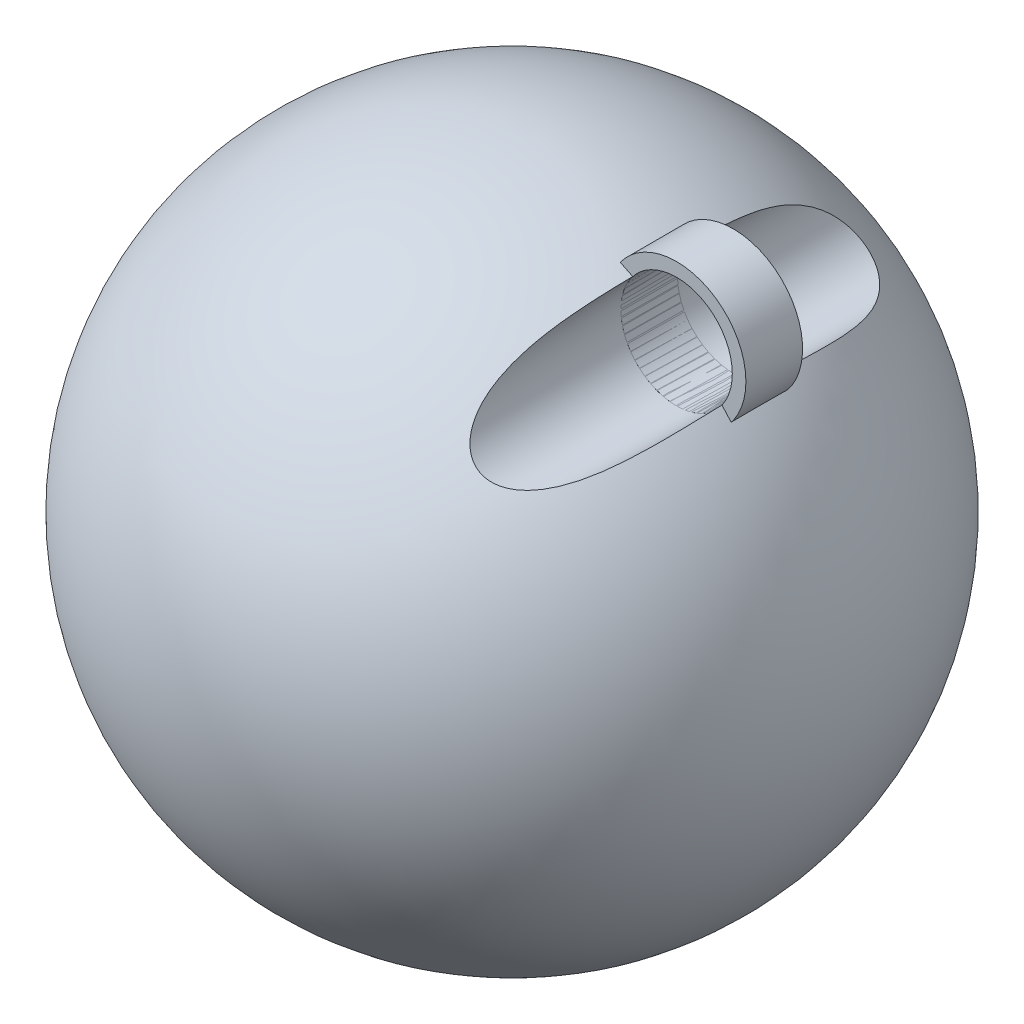
ISO-10303-21;
HEADER;
FILE_DESCRIPTION(('STEP AP214'),'2;1');
FILE_NAME('part.step','',(''),(''),'','','');
FILE_SCHEMA(('AUTOMOTIVE_DESIGN { 1 0 10303 214 1 1 1 1 }'));
ENDSEC;
DATA;
#1=APPLICATION_CONTEXT('core data for automotive mechanical design processes');
#2=APPLICATION_PROTOCOL_DEFINITION('international standard','automotive_design',2000,#1);
#3=PRODUCT_CONTEXT('',#1,'mechanical');
#4=PRODUCT('Part','Part','',(#3));
#5=PRODUCT_RELATED_PRODUCT_CATEGORY('part','',(#4));
#6=PRODUCT_DEFINITION_FORMATION('','',#4);
#7=PRODUCT_DEFINITION_CONTEXT('part definition',#1,'design');
#8=PRODUCT_DEFINITION('design','',#6,#7);
#9=PRODUCT_DEFINITION_SHAPE('','',#8);
#10=(LENGTH_UNIT() NAMED_UNIT(*) SI_UNIT(.MILLI.,.METRE.));
#11=(NAMED_UNIT(*) PLANE_ANGLE_UNIT() SI_UNIT($,.RADIAN.));
#12=(NAMED_UNIT(*) SI_UNIT($,.STERADIAN.) SOLID_ANGLE_UNIT());
#13=UNCERTAINTY_MEASURE_WITH_UNIT(LENGTH_MEASURE(1.E-05),#10,'distance_accuracy_value','');
#14=(GEOMETRIC_REPRESENTATION_CONTEXT(3) GLOBAL_UNCERTAINTY_ASSIGNED_CONTEXT((#13)) GLOBAL_UNIT_ASSIGNED_CONTEXT((#10,
#11,#12)) REPRESENTATION_CONTEXT('',''));
#15=CARTESIAN_POINT('',(0.,0.,0.));
#16=DIRECTION('',(0.,0.,1.));
#17=DIRECTION('',(1.,0.,0.));
#18=AXIS2_PLACEMENT_3D('',#15,#16,#17);
#19=CARTESIAN_POINT('',(170.114345327944,-163.089759289935,25.));
#20=DIRECTION('',(0.,0.,1.));
#21=DIRECTION('',(1.,0.,0.));
#22=AXIS2_PLACEMENT_3D('',#19,#20,#21);
#23=PLANE('',#22);
#24=CARTESIAN_POINT('',(170.114345327944,-163.089759289935,25.));
#25=DIRECTION('',(0.,0.,1.));
#26=DIRECTION('',(1.,0.,0.));
#27=AXIS2_PLACEMENT_3D('',#24,#25,#26);
#28=CIRCLE('',#27,61.1488225866109);
#29=CARTESIAN_POINT('',(231.263167914555,-163.089759289935,25.));
#30=VERTEX_POINT('',#29);
#31=EDGE_CURVE('E11',#30,#30,#28,.T.);
#32=ORIENTED_EDGE('',*,*,#31,.T.);
#33=EDGE_LOOP('',(#32));
#34=FACE_BOUND('',#33,.T.);
#35=CARTESIAN_POINT('',(170.114345327944,-163.089759289935,25.));
#36=DIRECTION('',(0.,0.,1.));
#37=DIRECTION('',(1.,0.,0.));
#38=AXIS2_PLACEMENT_3D('',#35,#36,#37);
#39=CIRCLE('',#38,49.1488225866109);
#40=CARTESIAN_POINT('',(219.263167914555,-163.089759289935,25.));
#41=VERTEX_POINT('',#40);
#42=EDGE_CURVE('E52',#41,#41,#39,.T.);
#43=ORIENTED_EDGE('',*,*,#42,.F.);
#44=EDGE_LOOP('',(#43));
#45=FACE_BOUND('',#44,.T.);
#46=ADVANCED_FACE('F41',(#34,#45),#23,.T.);
#47=CARTESIAN_POINT('',(170.114345327944,-163.089759289935,-25.));
#48=DIRECTION('',(0.,0.,1.));
#49=DIRECTION('',(1.,0.,0.));
#50=AXIS2_PLACEMENT_3D('',#47,#48,#49);
#51=PLANE('',#50);
#52=CARTESIAN_POINT('',(170.114345327944,-163.089759289935,-25.));
#53=DIRECTION('',(0.,0.,1.));
#54=DIRECTION('',(-1.,0.,0.));
#55=AXIS2_PLACEMENT_3D('',#52,#53,#54);
#56=CIRCLE('',#55,61.1488225866109);
#57=CARTESIAN_POINT('',(108.965522741333,-163.089759289935,-25.));
#58=VERTEX_POINT('',#57);
#59=EDGE_CURVE('E45',#58,#58,#56,.T.);
#60=ORIENTED_EDGE('',*,*,#59,.F.);
#61=EDGE_LOOP('',(#60));
#62=FACE_BOUND('',#61,.T.);
#63=CARTESIAN_POINT('',(170.114345327944,-163.089759289935,-25.));
#64=DIRECTION('',(0.,0.,1.));
#65=DIRECTION('',(-1.,0.,0.));
#66=AXIS2_PLACEMENT_3D('',#63,#64,#65);
#67=CIRCLE('',#66,49.1488225866109);
#68=CARTESIAN_POINT('',(120.965522741333,-163.089759289935,-25.));
#69=VERTEX_POINT('',#68);
#70=EDGE_CURVE('E54',#69,#69,#67,.T.);
#71=ORIENTED_EDGE('',*,*,#70,.T.);
#72=EDGE_LOOP('',(#71));
#73=FACE_BOUND('',#72,.T.);
#74=ADVANCED_FACE('F63',(#62,#73),#51,.F.);
#75=CARTESIAN_POINT('',(170.114345327944,-163.089759289935,25.));
#76=DIRECTION('',(0.,0.,-1.));
#77=DIRECTION('',(-1.,0.,0.));
#78=AXIS2_PLACEMENT_3D('',#75,#76,#77);
#79=CYLINDRICAL_SURFACE('',#78,61.1488225866109);
#80=ORIENTED_EDGE('',*,*,#59,.T.);
#81=EDGE_LOOP('',(#80));
#82=FACE_BOUND('',#81,.T.);
#83=ORIENTED_EDGE('',*,*,#31,.F.);
#84=EDGE_LOOP('',(#83));
#85=FACE_BOUND('',#84,.T.);
#86=ADVANCED_FACE('F43',(#82,#85),#79,.T.);
#87=CARTESIAN_POINT('',(170.114345327944,-163.089759289935,25.));
#88=DIRECTION('',(0.,0.,-1.));
#89=DIRECTION('',(-1.,0.,0.));
#90=AXIS2_PLACEMENT_3D('',#87,#88,#89);
#91=CYLINDRICAL_SURFACE('',#90,49.1488225866109);
#92=ORIENTED_EDGE('',*,*,#70,.F.);
#93=EDGE_LOOP('',(#92));
#94=FACE_BOUND('',#93,.T.);
#95=ORIENTED_EDGE('',*,*,#42,.T.);
#96=EDGE_LOOP('',(#95));
#97=FACE_BOUND('',#96,.T.);
#98=ADVANCED_FACE('F60',(#94,#97),#91,.F.);
#99=CLOSED_SHELL('',(#46,#74,#86,#98));
#100=MANIFOLD_SOLID_BREP('B2',#99);
#101=CARTESIAN_POINT('',(0.,-390.791383279883,0.));
#102=DIRECTION('',(0.,1.,0.));
#103=DIRECTION('',(1.,0.,0.));
#104=AXIS2_PLACEMENT_3D('',#101,#102,#103);
#105=SPHERICAL_SURFACE('',#104,290.733724493296);
#106=CARTESIAN_POINT('',(210.837597788635,-190.60745306454,0.));
#107=CARTESIAN_POINT('',(210.837598958615,-190.607454582091,2.01970869666685));
#108=CARTESIAN_POINT('',(210.825540884066,-190.625322197502,4.03944002432575));
#109=CARTESIAN_POINT('',(210.777196159714,-190.696662967204,8.07803600027789));
#110=CARTESIAN_POINT('',(210.740908730778,-190.750137266482,10.0969006186117));
#111=CARTESIAN_POINT('',(210.643755225287,-190.89229725101,14.133039942072));
#112=CARTESIAN_POINT('',(210.582886235639,-190.980987109535,16.1503144303575));
#113=CARTESIAN_POINT('',(210.436004006402,-191.192912415484,20.1821121932454));
#114=CARTESIAN_POINT('',(210.349990979497,-191.3161475707,22.1966354909744));
#115=CARTESIAN_POINT('',(210.151960530952,-191.596347648735,26.2235850643362));
#116=CARTESIAN_POINT('',(210.039923534538,-191.753337954948,28.2360086102781));
#117=CARTESIAN_POINT('',(209.788881430431,-192.099821472211,32.2563740738974));
#118=CARTESIAN_POINT('',(209.649876256304,-192.289314763331,34.2643159805221));
#119=CARTESIAN_POINT('',(209.343701662322,-192.699383211796,38.2747814679282));
#120=CARTESIAN_POINT('',(209.176533473046,-192.919957011016,40.2773052815695));
#121=CARTESIAN_POINT('',(208.812630405065,-193.390550674776,44.2761953918061));
#122=CARTESIAN_POINT('',(208.615895543002,-193.640570522743,46.2725616918667));
#123=CARTESIAN_POINT('',(208.190669888815,-194.168941910349,50.2639889580814));
#124=CARTESIAN_POINT('',(207.962090435522,-194.44737194911,52.2590300899655));
#125=CARTESIAN_POINT('',(207.471819736524,-195.029871740964,56.2412899336603));
#126=CARTESIAN_POINT('',(207.210128448186,-195.333941527069,58.2285086353958));
#127=CARTESIAN_POINT('',(206.651655147238,-195.965425568919,62.1944394016872));
#128=CARTESIAN_POINT('',(206.354870629095,-196.292841490833,64.1731508483898));
#129=CARTESIAN_POINT('',(205.72409230294,-196.968458672744,68.1210715339619));
#130=CARTESIAN_POINT('',(205.390098604088,-197.316659871762,70.0902808006899));
#131=CARTESIAN_POINT('',(204.682906005877,-198.030762067019,74.0165673707267));
#132=CARTESIAN_POINT('',(204.309742215011,-198.39664705704,75.9736539011148));
#133=CARTESIAN_POINT('',(203.521478511531,-199.14339965041,79.876527234849));
#134=CARTESIAN_POINT('',(203.106378111917,-199.52426742772,81.822313906695));
#135=CARTESIAN_POINT('',(202.231646941506,-200.297641260784,85.701198097665));
#136=CARTESIAN_POINT('',(201.772023405326,-200.690145418561,87.6342976240131));
#137=CARTESIAN_POINT('',(200.805342750153,-201.483252586202,91.4868612127236));
#138=CARTESIAN_POINT('',(200.298287606098,-201.88385525832,93.4063258392327));
#139=CARTESIAN_POINT('',(199.236388849421,-202.687162263821,97.220476414304));
#140=CARTESIAN_POINT('',(198.681805095931,-203.089845113391,99.1152390923504));
#141=CARTESIAN_POINT('',(197.519372603209,-203.895042971176,102.888351129933));
#142=CARTESIAN_POINT('',(196.911525751961,-204.297557984832,104.766701068649));
#143=CARTESIAN_POINT('',(195.638778587633,-205.097799161152,108.505859445458));
#144=CARTESIAN_POINT('',(194.973857211907,-205.495523493594,110.366661123983));
#145=CARTESIAN_POINT('',(193.583321362438,-206.280632298934,114.067703094693));
#146=CARTESIAN_POINT('',(192.857707270244,-206.668016836813,115.907943516055));
#147=CARTESIAN_POINT('',(191.345988079359,-207.424106252077,119.55445647576));
#148=CARTESIAN_POINT('',(190.560257294487,-207.792906245502,121.360863948923));
#149=CARTESIAN_POINT('',(188.92014196635,-208.507256019495,124.947154206296));
#150=CARTESIAN_POINT('',(188.065752491861,-208.852804126777,126.727035074403));
#151=CARTESIAN_POINT('',(186.284243990706,-209.512198859396,130.254152162765));
#152=CARTESIAN_POINT('',(185.35719306221,-209.826074551523,132.001417092864));
#153=CARTESIAN_POINT('',(183.907785739474,-210.266047236191,134.594316398703));
#154=CARTESIAN_POINT('',(183.41488204009,-210.407555667736,135.453889547025));
#155=CARTESIAN_POINT('',(182.408715339696,-210.678905737093,137.162881398466));
#156=CARTESIAN_POINT('',(181.895453474931,-210.808748024706,138.012300664868));
#157=CARTESIAN_POINT('',(181.007536516204,-211.017674076955,139.44270429103));
#158=CARTESIAN_POINT('',(180.638328705885,-211.100164497358,140.026578181076));
#159=CARTESIAN_POINT('',(179.889485197215,-211.258211644856,141.188512029896));
#160=CARTESIAN_POINT('',(179.509849870199,-211.333768618442,141.766572194705));
#161=CARTESIAN_POINT('',(178.354918198143,-211.549160174947,143.491402226556));
#162=CARTESIAN_POINT('',(177.563538592855,-211.67772914253,144.628914634896));
#163=CARTESIAN_POINT('',(175.934651650875,-211.899671493773,146.876800061264));
#164=CARTESIAN_POINT('',(175.097073124525,-211.992988716115,147.98712715962));
#165=CARTESIAN_POINT('',(173.374878503983,-212.137924418238,150.173677846923));
#166=CARTESIAN_POINT('',(172.49026254574,-212.189543018529,151.24990153442));
#167=CARTESIAN_POINT('',(170.664607735727,-212.244057301531,153.37052197647));
#168=CARTESIAN_POINT('',(169.723161735851,-212.246545290171,154.414580689146));
#169=CARTESIAN_POINT('',(167.788942421119,-212.193073047921,156.453149152825));
#170=CARTESIAN_POINT('',(166.796160959021,-212.137103512247,157.447650989372));
#171=CARTESIAN_POINT('',(164.760814327533,-211.956808300346,159.37419975286));
#172=CARTESIAN_POINT('',(163.718346919355,-211.832612175565,160.306361302719));
#173=CARTESIAN_POINT('',(161.583224537301,-211.504552320303,162.096136272709));
#174=CARTESIAN_POINT('',(160.490597118145,-211.300731878953,162.953789891182));
#175=CARTESIAN_POINT('',(158.670130457582,-210.893085835918,164.278044647717));
#176=CARTESIAN_POINT('',(157.956148252519,-210.716909061854,164.772334523284));
#177=CARTESIAN_POINT('',(156.511256992931,-210.324526115781,165.719108080477));
#178=CARTESIAN_POINT('',(155.780345026342,-210.108313011769,166.171584502037));
#179=CARTESIAN_POINT('',(154.304465861058,-209.632808585065,167.028697998473));
#180=CARTESIAN_POINT('',(153.559498693743,-209.373517358543,167.433335180146));
#181=CARTESIAN_POINT('',(152.05966229757,-208.809302810648,168.188180264983));
#182=CARTESIAN_POINT('',(151.304798096822,-208.504401899319,168.538414727281));
#183=CARTESIAN_POINT('',(149.78037298893,-207.842805035192,169.182031928471));
#184=CARTESIAN_POINT('',(149.01074641309,-207.48550830941,169.474647847077));
#185=CARTESIAN_POINT('',(147.472795022065,-206.721216100618,169.990737050309));
#186=CARTESIAN_POINT('',(146.704470198603,-206.314220934778,170.214210776162));
#187=CARTESIAN_POINT('',(145.177994835921,-205.45191760678,170.585851546221));
#188=CARTESIAN_POINT('',(144.419832375812,-204.996672895791,170.73411604553));
#189=CARTESIAN_POINT('',(142.92138419683,-204.040205839355,170.951384021044));
#190=CARTESIAN_POINT('',(142.18109518079,-203.538992057102,171.020402227124));
#191=CARTESIAN_POINT('',(140.833126472211,-202.571424248958,171.072970565847));
#192=CARTESIAN_POINT('',(140.22184700521,-202.110639441859,171.067513105392));
#193=CARTESIAN_POINT('',(139.02361206709,-201.162799211314,170.997422597534));
#194=CARTESIAN_POINT('',(138.436653939412,-200.675746670472,170.93279603093));
#195=CARTESIAN_POINT('',(137.291128532372,-199.679643256719,170.745812474317));
#196=CARTESIAN_POINT('',(136.732568062335,-199.170587161328,170.623441709782));
#197=CARTESIAN_POINT('',(135.647185697444,-198.135219165598,170.323594950034));
#198=CARTESIAN_POINT('',(135.120364792487,-197.608906727857,170.146117237201));
#199=CARTESIAN_POINT('',(134.124284390231,-196.568362210911,169.749005971127));
#200=CARTESIAN_POINT('',(133.653488542787,-196.054701570457,169.531708697142));
#201=CARTESIAN_POINT('',(132.743703427767,-195.019630734949,169.053720873291));
#202=CARTESIAN_POINT('',(132.30471203136,-194.498221061397,168.793033231617));
#203=CARTESIAN_POINT('',(131.458694640936,-193.450929150136,168.231944495868));
#204=CARTESIAN_POINT('',(131.051669217807,-192.925046832733,167.931542692784));
#205=CARTESIAN_POINT('',(130.26910885842,-191.871605582049,167.294686589024));
#206=CARTESIAN_POINT('',(129.893581581504,-191.344046273159,166.958223564458));
#207=CARTESIAN_POINT('',(128.947641733981,-189.959576524706,166.031911931746));
#208=CARTESIAN_POINT('',(128.402399418798,-189.103240120558,165.415300807517));
#209=CARTESIAN_POINT('',(127.387628312007,-187.400619002815,164.110016423109));
#210=CARTESIAN_POINT('',(126.91813946039,-186.554339808143,163.421305462715));
#211=CARTESIAN_POINT('',(126.047548038708,-184.875541549987,161.982084113617));
#212=CARTESIAN_POINT('',(125.646615119495,-184.043061097903,161.231427040259));
#213=CARTESIAN_POINT('',(124.907891368782,-182.397701134824,159.679697342722));
#214=CARTESIAN_POINT('',(124.570097280813,-181.584820614822,158.878627321507));
#215=CARTESIAN_POINT('',(124.002458368011,-180.113710934646,157.370240947969));
#216=CARTESIAN_POINT('',(123.764000300545,-179.452154811468,156.669354120518));
#217=CARTESIAN_POINT('',(123.32306724717,-178.144955837082,155.241753189245));
#218=CARTESIAN_POINT('',(123.120597481919,-177.499315306356,154.515035356557));
#219=CARTESIAN_POINT('',(122.748381673794,-176.224202480762,153.038703947647));
#220=CARTESIAN_POINT('',(122.578654383695,-175.594739629238,152.289077533881));
#221=CARTESIAN_POINT('',(122.269137943259,-174.352641298138,150.770069652899));
#222=CARTESIAN_POINT('',(122.129347638585,-173.740005170535,150.000688948668));
#223=CARTESIAN_POINT('',(121.876848376629,-172.530769528413,148.443343126605));
#224=CARTESIAN_POINT('',(121.764177877114,-171.934193840366,147.655353337252));
#225=CARTESIAN_POINT('',(121.563735904175,-170.757940755776,146.063787646781));
#226=CARTESIAN_POINT('',(121.475964392312,-170.178263333148,145.260211769726));
#227=CARTESIAN_POINT('',(121.323124998667,-169.035818683667,143.639326751395));
#228=CARTESIAN_POINT('',(121.258051597601,-168.473047376376,142.822020999417));
#229=CARTESIAN_POINT('',(121.148564504752,-167.364047330181,141.174849977928));
#230=CARTESIAN_POINT('',(121.104152075435,-166.81781960406,140.344983944132));
#231=CARTESIAN_POINT('',(121.034960938849,-165.754034749093,138.693087685374));
#232=CARTESIAN_POINT('',(121.009755868684,-165.236107502346,137.871313280703));
#233=CARTESIAN_POINT('',(120.97576828294,-164.215609391513,136.217931783849));
#234=CARTESIAN_POINT('',(120.966986482925,-163.713039197474,135.386324264826));
#235=CARTESIAN_POINT('',(120.963096996661,-162.227854193371,132.877829718026));
#236=CARTESIAN_POINT('',(120.990451216586,-161.267865704533,131.187427628832));
#237=CARTESIAN_POINT('',(121.094925935914,-159.405559789903,127.77520234297));
#238=CARTESIAN_POINT('',(121.172085174856,-158.503287858399,126.053355701892));
#239=CARTESIAN_POINT('',(121.367534489703,-156.755037770473,122.583815522603));
#240=CARTESIAN_POINT('',(121.485822205515,-155.909056387225,120.836123472998));
#241=CARTESIAN_POINT('',(121.75636022008,-154.269078752489,117.313637017968));
#242=CARTESIAN_POINT('',(121.908698057517,-153.475223441363,115.53878394159));
#243=CARTESIAN_POINT('',(122.240525154728,-151.939830725788,111.969151547874));
#244=CARTESIAN_POINT('',(122.420014484041,-151.198293455342,110.174372179512));
#245=CARTESIAN_POINT('',(122.800209371282,-149.765787725848,106.567675680821));
#246=CARTESIAN_POINT('',(123.000908232566,-149.074803421249,104.75576412331));
#247=CARTESIAN_POINT('',(123.418327835093,-147.74124675897,101.116004260348));
#248=CARTESIAN_POINT('',(123.635049122851,-147.098676054154,99.2881554131623));
#249=CARTESIAN_POINT('',(124.075534212393,-145.872002981992,95.653093275471));
#250=CARTESIAN_POINT('',(124.29908498003,-145.287019482522,93.8461509312504));
#251=CARTESIAN_POINT('',(124.752986963876,-144.160343608601,90.2196099918483));
#252=CARTESIAN_POINT('',(124.983338437894,-143.618652878237,88.4000109188646));
#253=CARTESIAN_POINT('',(125.447142502013,-142.577011730233,84.74902219296));
#254=CARTESIAN_POINT('',(125.680595538211,-142.077067393977,82.9176308639181));
#255=CARTESIAN_POINT('',(126.147138088071,-141.117595214854,79.2442778810777));
#256=CARTESIAN_POINT('',(126.380227605548,-140.658066945162,77.4023163391275));
#257=CARTESIAN_POINT('',(126.843050131485,-139.777761692372,73.7072877774297));
#258=CARTESIAN_POINT('',(127.072780536344,-139.35701355318,71.8542135660787));
#259=CARTESIAN_POINT('',(127.525775736067,-138.553393453466,68.1390848348613));
#260=CARTESIAN_POINT('',(127.749040514031,-138.170521591937,66.2770302915375));
#261=CARTESIAN_POINT('',(128.186380159121,-137.441500686264,62.5447869888565));
#262=CARTESIAN_POINT('',(128.400455547581,-137.095349557232,60.6745986975905));
#263=CARTESIAN_POINT('',(128.816930863831,-136.438652459194,56.9266904307424));
#264=CARTESIAN_POINT('',(129.019330802052,-136.128106458373,55.0489704618911));
#265=CARTESIAN_POINT('',(129.410090402344,-135.541719737287,51.2873908482343));
#266=CARTESIAN_POINT('',(129.598455282864,-135.265866091363,49.4035337599787));
#267=CARTESIAN_POINT('',(129.959144683675,-134.747807230096,45.629667669437));
#268=CARTESIAN_POINT('',(130.131469203326,-134.505602016094,43.739658666906));
#269=CARTESIAN_POINT('',(130.458204291972,-134.054006876645,39.9541642645475));
#270=CARTESIAN_POINT('',(130.612614721225,-133.844617207178,38.058678822118));
#271=CARTESIAN_POINT('',(130.901859500353,-133.457917943395,34.2629471641425));
#272=CARTESIAN_POINT('',(131.036693851045,-133.28060834774,32.362700948795));
#273=CARTESIAN_POINT('',(131.285298213789,-132.957494155715,28.5589203311764));
#274=CARTESIAN_POINT('',(131.399076588467,-132.81167704788,26.6553875386965));
#275=CARTESIAN_POINT('',(131.604428028867,-132.550922110568,22.8450120368033));
#276=CARTESIAN_POINT('',(131.69600110686,-132.435984264026,20.9381693292198));
#277=CARTESIAN_POINT('',(131.855973267148,-132.236557257214,17.12191850834));
#278=CARTESIAN_POINT('',(131.92437233257,-132.152068119112,15.2125103931768));
#279=CARTESIAN_POINT('',(132.037274310009,-132.013217867966,11.3918901926049));
#280=CARTESIAN_POINT('',(132.081777181122,-131.95885680649,9.48067810411391));
#281=CARTESIAN_POINT('',(132.147736881478,-131.878443249454,5.57907466527623));
#282=CARTESIAN_POINT('',(132.168177299464,-131.853638753012,3.58864019569804));
#283=CARTESIAN_POINT('',(132.182423169999,-131.836340892232,-0.392466807619412));
#284=CARTESIAN_POINT('',(132.176228574989,-131.843847585589,-2.38313934177743));
#285=CARTESIAN_POINT('',(132.137275277884,-131.891203990236,-6.3638601449181));
#286=CARTESIAN_POINT('',(132.104516302948,-131.931054033722,-8.35390840727887));
#287=CARTESIAN_POINT('',(132.012808341637,-132.043263714588,-12.3324825917722));
#288=CARTESIAN_POINT('',(131.953859366327,-132.115623338235,-14.3210085145476));
#289=CARTESIAN_POINT('',(131.810419029478,-132.293184509771,-18.2964117431795));
#290=CARTESIAN_POINT('',(131.725918183824,-132.398398252635,-20.2832881617349));
#291=CARTESIAN_POINT('',(131.532350102816,-132.64208920226,-24.2538009533437));
#292=CARTESIAN_POINT('',(131.423282860738,-132.780566418126,-26.2374373255102));
#293=CARTESIAN_POINT('',(131.181836014308,-133.091339452485,-30.2006166838031));
#294=CARTESIAN_POINT('',(131.049456641538,-133.263634935029,-32.1801597103951));
#295=CARTESIAN_POINT('',(130.762911795131,-133.64272398372,-36.1343583827567));
#296=CARTESIAN_POINT('',(130.608746322855,-133.849517547709,-38.1090140288319));
#297=CARTESIAN_POINT('',(130.280319615304,-134.298535461446,-42.0538478685124));
#298=CARTESIAN_POINT('',(130.106046155676,-134.540781388202,-44.0240225880389));
#299=CARTESIAN_POINT('',(129.739527818705,-135.061519169144,-47.9579014451521));
#300=CARTESIAN_POINT('',(129.547282926619,-135.340011053065,-49.9216055774295));
#301=CARTESIAN_POINT('',(129.147108056613,-135.934270768396,-53.8418596191302));
#302=CARTESIAN_POINT('',(128.939177334436,-136.250040368955,-55.7984091844611));
#303=CARTESIAN_POINT('',(128.510177985743,-136.919963140701,-59.7034784362853));
#304=CARTESIAN_POINT('',(128.289109388812,-137.274116225453,-61.6519981408504));
#305=CARTESIAN_POINT('',(127.836750412099,-138.021800979861,-65.5390563574377));
#306=CARTESIAN_POINT('',(127.605466225551,-138.415308968587,-67.4776001425465));
#307=CARTESIAN_POINT('',(127.135574514885,-139.243196034339,-71.3450745466103));
#308=CARTESIAN_POINT('',(126.896966924201,-139.677575482943,-73.274005078));
#309=CARTESIAN_POINT('',(126.415743379486,-140.588552827664,-77.1211186601131));
#310=CARTESIAN_POINT('',(126.173127932719,-141.065145413773,-79.0393030304162));
#311=CARTESIAN_POINT('',(125.687428149807,-142.062081257018,-82.8641536182408));
#312=CARTESIAN_POINT('',(125.444343829345,-142.582423074886,-84.7708202124654));
#313=CARTESIAN_POINT('',(124.959443580326,-143.673245098473,-88.5883543131187));
#314=CARTESIAN_POINT('',(124.71765760581,-144.244125988318,-90.4991113060281));
#315=CARTESIAN_POINT('',(124.24187743498,-145.433772354823,-94.3065833249877));
#316=CARTESIAN_POINT('',(124.00788295171,-146.052536065197,-96.2032988661695));
#317=CARTESIAN_POINT('',(123.552392668802,-147.339913395024,-99.9816099724084));
#318=CARTESIAN_POINT('',(123.330898785581,-148.008534621659,-101.863203181406));
#319=CARTESIAN_POINT('',(122.905697210084,-149.397503320921,-105.609273280036));
#320=CARTESIAN_POINT('',(122.70198953447,-150.117850842004,-107.473750153633));
#321=CARTESIAN_POINT('',(122.318875464879,-151.609735562428,-111.177058382529));
#322=CARTESIAN_POINT('',(122.139386763872,-152.38108539305,-113.015956518327));
#323=CARTESIAN_POINT('',(121.810370801944,-153.979399667238,-116.672295643198));
#324=CARTESIAN_POINT('',(121.660844739064,-154.806366332853,-118.489735771549));
#325=CARTESIAN_POINT('',(121.399216527299,-156.517698391699,-122.099029963055));
#326=CARTESIAN_POINT('',(121.28709450411,-157.402033003652,-123.890897128125));
#327=CARTESIAN_POINT('',(121.108647207785,-159.230698289591,-127.445855729292));
#328=CARTESIAN_POINT('',(121.042315305086,-160.175020256887,-129.208951294881));
#329=CARTESIAN_POINT('',(120.967965360391,-162.057900876383,-132.579431704341));
#330=CARTESIAN_POINT('',(120.956190475936,-162.992236044675,-134.189077319039));
#331=CARTESIAN_POINT('',(120.981600005643,-164.435594849647,-136.577721000067));
#332=CARTESIAN_POINT('',(120.997249784398,-164.923708155925,-137.369658518035));
#333=CARTESIAN_POINT('',(121.044236927506,-165.914139337299,-138.944168274912));
#334=CARTESIAN_POINT('',(121.075574400587,-166.416457310819,-139.726740448875));
#335=CARTESIAN_POINT('',(121.155406324068,-167.436124230112,-141.282561234478));
#336=CARTESIAN_POINT('',(121.203922239029,-167.953491234005,-142.055796924432));
#337=CARTESIAN_POINT('',(121.31966255762,-169.002823513351,-143.590878878154));
#338=CARTESIAN_POINT('',(121.386886602203,-169.534788508462,-144.352725360209));
#339=CARTESIAN_POINT('',(121.541737676517,-170.613413964997,-145.863751373903));
#340=CARTESIAN_POINT('',(121.629362805556,-171.160073053233,-146.612932078596));
#341=CARTESIAN_POINT('',(121.826878298322,-172.268215172732,-148.097274759556));
#342=CARTESIAN_POINT('',(121.936768118541,-172.829697841844,-148.83243707755));
#343=CARTESIAN_POINT('',(122.161821837529,-173.878800974853,-150.173691528373));
#344=CARTESIAN_POINT('',(122.273492566692,-174.364289597701,-150.78203749575));
#345=CARTESIAN_POINT('',(122.515478831985,-175.345784324213,-151.986407138574));
#346=CARTESIAN_POINT('',(122.645793780976,-175.841790096255,-152.582431201383));
#347=CARTESIAN_POINT('',(122.926534381746,-176.844333062744,-153.760995612103));
#348=CARTESIAN_POINT('',(123.076964619806,-177.350872636586,-154.343532849381));
#349=CARTESIAN_POINT('',(123.399454889668,-178.374182010359,-155.493485696086));
#350=CARTESIAN_POINT('',(123.571515246829,-178.890951964075,-156.060901077896));
#351=CARTESIAN_POINT('',(123.938491260306,-179.933208718422,-157.177589644443));
#352=CARTESIAN_POINT('',(124.133353517317,-180.45867277322,-157.726901503311));
#353=CARTESIAN_POINT('',(124.547969776324,-181.518982289427,-158.806736648125));
#354=CARTESIAN_POINT('',(124.767722811753,-182.053827385867,-159.337260662597));
#355=CARTESIAN_POINT('',(125.233826467317,-183.131972816228,-160.376964855374));
#356=CARTESIAN_POINT('',(125.480158873086,-183.675267144264,-160.88615932241));
#357=CARTESIAN_POINT('',(126.001356905247,-184.769674631978,-161.880907130057));
#358=CARTESIAN_POINT('',(126.276227218074,-185.320789062989,-162.366456568437));
#359=CARTESIAN_POINT('',(127.248364562439,-187.178685610658,-163.94880100174));
#360=CARTESIAN_POINT('',(128.015309783556,-188.502115023507,-164.98672552482));
#361=CARTESIAN_POINT('',(129.308247865399,-190.495899703223,-166.397253641711));
#362=CARTESIAN_POINT('',(129.762904676712,-191.161837920372,-166.842982775696));
#363=CARTESIAN_POINT('',(130.722188327808,-192.492768135873,-167.679198300722));
#364=CARTESIAN_POINT('',(131.226807606657,-193.157760261996,-168.069693028853));
#365=CARTESIAN_POINT('',(132.203233308233,-194.376564933558,-168.731219369922));
#366=CARTESIAN_POINT('',(132.667644784524,-194.931357000052,-169.011378394231));
#367=CARTESIAN_POINT('',(133.632390802732,-196.032272335393,-169.522777801838));
#368=CARTESIAN_POINT('',(134.132722084894,-196.578396385391,-169.754022616647));
#369=CARTESIAN_POINT('',(135.167872379904,-197.65721830352,-170.163273191608));
#370=CARTESIAN_POINT('',(135.702671111407,-198.189923815294,-170.341309918993));
#371=CARTESIAN_POINT('',(136.804763764133,-199.237461835363,-170.640706450263));
#372=CARTESIAN_POINT('',(137.372057720419,-199.752294324371,-170.762066192992));
#373=CARTESIAN_POINT('',(138.538689763037,-200.761800645218,-170.945881039593));
#374=CARTESIAN_POINT('',(139.138176098639,-201.25635868374,-171.008033535966));
#375=CARTESIAN_POINT('',(140.362004443233,-202.217888732788,-171.070891654675));
#376=CARTESIAN_POINT('',(140.986346508796,-202.684860680521,-171.071597137148));
#377=CARTESIAN_POINT('',(142.254610966748,-203.587262511623,-171.011543655117));
#378=CARTESIAN_POINT('',(142.898534877056,-204.022689940871,-170.95077991388));
#379=CARTESIAN_POINT('',(144.200194794239,-204.858910187034,-170.769213930025));
#380=CARTESIAN_POINT('',(144.857930486663,-205.259703791392,-170.648413052849));
#381=CARTESIAN_POINT('',(146.130371199079,-205.995161268114,-170.361046461585));
#382=CARTESIAN_POINT('',(146.744478592511,-206.332541660618,-170.198733300977));
#383=CARTESIAN_POINT('',(147.975370969843,-206.975459225133,-169.828179564313));
#384=CARTESIAN_POINT('',(148.592155722701,-207.280999090046,-169.619942876872));
#385=CARTESIAN_POINT('',(149.824774051942,-207.860329828041,-169.160816662396));
#386=CARTESIAN_POINT('',(150.440607492788,-208.134116526807,-168.909921538088));
#387=CARTESIAN_POINT('',(151.668226449594,-208.650609247725,-168.368948426046));
#388=CARTESIAN_POINT('',(152.280010977057,-208.893307927586,-168.078861215139));
#389=CARTESIAN_POINT('',(153.345037858275,-209.291869067378,-167.539892309757));
#390=CARTESIAN_POINT('',(153.79978663132,-209.454297019526,-167.298763920106));
#391=CARTESIAN_POINT('',(154.704453267803,-209.762774574088,-166.797975523613));
#392=CARTESIAN_POINT('',(155.154372005532,-209.908827187415,-166.538318937941));
#393=CARTESIAN_POINT('',(156.496271492098,-210.323556922088,-165.733350877229));
#394=CARTESIAN_POINT('',(157.38016576142,-210.568720882625,-165.162158376785));
#395=CARTESIAN_POINT('',(159.123239161828,-211.002295584743,-163.960202921173));
#396=CARTESIAN_POINT('',(159.982363019183,-211.190587133158,-163.329318445736));
#397=CARTESIAN_POINT('',(161.671681548028,-211.515661264376,-162.017749400776));
#398=CARTESIAN_POINT('',(162.501876576648,-211.65244448326,-161.337065446356));
#399=CARTESIAN_POINT('',(163.971518910797,-211.857671394331,-160.071612548935));
#400=CARTESIAN_POINT('',(164.616345847067,-211.93426728373,-159.494338004957));
#401=CARTESIAN_POINT('',(165.886398846719,-212.060551846458,-158.315652136867));
#402=CARTESIAN_POINT('',(166.511622309026,-212.110236963262,-157.714237633694));
#403=CARTESIAN_POINT('',(167.742684465965,-212.185201753086,-156.48986481892));
#404=CARTESIAN_POINT('',(168.348513040942,-212.210468879935,-155.866895602406));
#405=CARTESIAN_POINT('',(169.540634155789,-212.238849653967,-154.602134638621));
#406=CARTESIAN_POINT('',(170.126927362143,-212.241964057703,-153.960343534901));
#407=CARTESIAN_POINT('',(171.281167757185,-212.228124021076,-152.659032382179));
#408=CARTESIAN_POINT('',(171.849086666179,-212.211140028638,-151.999487623648));
#409=CARTESIAN_POINT('',(172.966074634091,-212.158965338507,-150.665365724296));
#410=CARTESIAN_POINT('',(173.515143741078,-212.123774687244,-149.990788621816));
#411=CARTESIAN_POINT('',(174.594781070327,-212.036931856435,-148.628275559747));
#412=CARTESIAN_POINT('',(175.12535311098,-211.985283096965,-147.940342403478));
#413=CARTESIAN_POINT('',(176.168617178829,-211.867090633205,-146.552283505896));
#414=CARTESIAN_POINT('',(176.68130810873,-211.800546016663,-145.852157020262));
#415=CARTESIAN_POINT('',(178.138318639246,-211.588736569297,-143.812226857399));
#416=CARTESIAN_POINT('',(179.060290761058,-211.426153342797,-142.458178228064));
#417=CARTESIAN_POINT('',(180.845507537431,-211.061404783941,-139.717018880213));
#418=CARTESIAN_POINT('',(181.708741173164,-210.859232052372,-138.329902023926));
#419=CARTESIAN_POINT('',(183.3802818608,-210.422289245236,-135.526651950845));
#420=CARTESIAN_POINT('',(184.188547651189,-210.187495076094,-134.110497952873));
#421=CARTESIAN_POINT('',(185.752522535676,-209.691551513398,-131.254190315306));
#422=CARTESIAN_POINT('',(186.508234441511,-209.43040353166,-129.814037964789));
#423=CARTESIAN_POINT('',(187.9719381483,-208.88631185528,-126.909102111995));
#424=CARTESIAN_POINT('',(188.679804252244,-208.603314638262,-125.444265468144));
#425=CARTESIAN_POINT('',(190.048465931952,-208.020714127386,-122.496072722369));
#426=CARTESIAN_POINT('',(190.709261405863,-207.721110797597,-121.01271658038));
#427=CARTESIAN_POINT('',(191.986124655154,-207.109447415817,-118.03006911528));
#428=CARTESIAN_POINT('',(192.602207442252,-206.797391599633,-116.530783335964));
#429=CARTESIAN_POINT('',(193.792287948495,-206.16429980266,-113.517453154709));
#430=CARTESIAN_POINT('',(194.366284301763,-205.843263530884,-112.003408275583));
#431=CARTESIAN_POINT('',(195.490941412133,-205.185744863097,-108.916605599861));
#432=CARTESIAN_POINT('',(196.040392706352,-204.849087544741,-107.343445069759));
#433=CARTESIAN_POINT('',(197.099269318191,-204.172788289275,-104.184290879597));
#434=CARTESIAN_POINT('',(197.608692851352,-203.833146219851,-102.598296650877));
#435=CARTESIAN_POINT('',(198.589682670814,-203.15368281256,-99.4143887247251));
#436=CARTESIAN_POINT('',(199.061242438001,-202.813861453918,-97.8164730262788));
#437=CARTESIAN_POINT('',(199.968379992384,-202.136701736594,-94.6099753618337));
#438=CARTESIAN_POINT('',(200.403958227399,-201.799363347057,-93.0013935288525));
#439=CARTESIAN_POINT('',(201.241379166503,-201.129243502799,-89.7729058612192));
#440=CARTESIAN_POINT('',(201.643190633908,-200.796466500701,-88.1529910108808));
#441=CARTESIAN_POINT('',(202.414384207602,-200.137988974459,-84.904033442367));
#442=CARTESIAN_POINT('',(202.783766212618,-199.812288472417,-83.274990695703));
#443=CARTESIAN_POINT('',(203.491715833945,-199.170034954535,-80.0085903332665));
#444=CARTESIAN_POINT('',(203.830286139345,-198.853481142068,-78.3712334563029));
#445=CARTESIAN_POINT('',(204.478206010047,-198.231380503084,-75.0886329125338));
#446=CARTESIAN_POINT('',(204.787554930004,-197.925833919751,-73.4433890723901));
#447=CARTESIAN_POINT('',(205.378276161683,-197.327727790361,-70.1467593274002));
#448=CARTESIAN_POINT('',(205.659667805279,-197.035159348773,-68.4953784974777));
#449=CARTESIAN_POINT('',(206.196091755011,-196.464416025223,-65.1858253685266));
#450=CARTESIAN_POINT('',(206.451123458321,-196.186241472508,-63.5276529150816));
#451=CARTESIAN_POINT('',(206.936107742113,-195.645809366199,-60.20500609854));
#452=CARTESIAN_POINT('',(207.166059536811,-195.383552311435,-58.5405315396804));
#453=CARTESIAN_POINT('',(207.602063925786,-194.876384521241,-55.2058570828873));
#454=CARTESIAN_POINT('',(207.808117020587,-194.631473422568,-53.5356573056147));
#455=CARTESIAN_POINT('',(208.197315178416,-194.160443991267,-50.1910193027973));
#456=CARTESIAN_POINT('',(208.380474382155,-193.934314087443,-48.5165843518344));
#457=CARTESIAN_POINT('',(208.725046821647,-193.501877365738,-45.1629531365158));
#458=CARTESIAN_POINT('',(208.886460425884,-193.295570211972,-43.483756953333));
#459=CARTESIAN_POINT('',(209.188459707747,-192.903875081775,-40.1211750276017));
#460=CARTESIAN_POINT('',(209.329046805938,-192.718485678759,-38.4377895787725));
#461=CARTESIAN_POINT('',(209.590234898376,-192.369588536516,-35.0672346710537));
#462=CARTESIAN_POINT('',(209.710836282552,-192.20608037039,-33.3800652866413));
#463=CARTESIAN_POINT('',(209.908250309395,-191.935441493796,-30.3758331535553));
#464=CARTESIAN_POINT('',(209.988848957623,-191.823838961063,-29.0594198685652));
#465=CARTESIAN_POINT('',(210.138665304616,-191.614783985942,-26.4248742845359));
#466=CARTESIAN_POINT('',(210.207883347372,-191.517331115877,-25.1067420386683));
#467=CARTESIAN_POINT('',(210.398874472113,-191.246692422893,-21.150259219294));
#468=CARTESIAN_POINT('',(210.504002731202,-191.095201288908,-18.5095439745066));
#469=CARTESIAN_POINT('',(210.629615946615,-190.912856327012,-14.5460702770862));
#470=CARTESIAN_POINT('',(210.666136387423,-190.859562807784,-13.2247769568224));
#471=CARTESIAN_POINT('',(210.728637012342,-190.76807619661,-10.581422330477));
#472=CARTESIAN_POINT('',(210.754617333239,-190.729882908696,-9.25936103458512));
#473=CARTESIAN_POINT('',(210.796147729764,-190.668719878727,-6.61457268175927));
#474=CARTESIAN_POINT('',(210.811696607049,-190.645751885725,-5.29184556579837));
#475=CARTESIAN_POINT('',(210.832421468628,-190.615117663901,-2.64608221068426));
#476=CARTESIAN_POINT('',(210.837597022219,-190.607452070441,-1.32304596097663));
#477=CARTESIAN_POINT('',(210.837597788635,-190.60745306454,0.));
#478=B_SPLINE_CURVE_WITH_KNOTS('',3,(#106,#107,#108,#109,#110,#111,#112,#113,#114,#115,#116,
#117,#118,#119,#120,#121,#122,#123,#124,#125,#126,#127,#128,#129,#130,#131,#132,#133,#134,#135,
#136,#137,#138,#139,#140,#141,#142,#143,#144,#145,#146,#147,#148,#149,#150,#151,#152,#153,#154,
#155,#156,#157,#158,#159,#160,#161,#162,#163,#164,#165,#166,#167,#168,#169,#170,#171,#172,#173,
#174,#175,#176,#177,#178,#179,#180,#181,#182,#183,#184,#185,#186,#187,#188,#189,#190,#191,#192,
#193,#194,#195,#196,#197,#198,#199,#200,#201,#202,#203,#204,#205,#206,#207,#208,#209,#210,#211,
#212,#213,#214,#215,#216,#217,#218,#219,#220,#221,#222,#223,#224,#225,#226,#227,#228,#229,#230,
#231,#232,#233,#234,#235,#236,#237,#238,#239,#240,#241,#242,#243,#244,#245,#246,#247,#248,#249,
#250,#251,#252,#253,#254,#255,#256,#257,#258,#259,#260,#261,#262,#263,#264,#265,#266,#267,#268,
#269,#270,#271,#272,#273,#274,#275,#276,#277,#278,#279,#280,#281,#282,#283,#284,#285,#286,#287,
#288,#289,#290,#291,#292,#293,#294,#295,#296,#297,#298,#299,#300,#301,#302,#303,#304,#305,#306,
#307,#308,#309,#310,#311,#312,#313,#314,#315,#316,#317,#318,#319,#320,#321,#322,#323,#324,#325,
#326,#327,#328,#329,#330,#331,#332,#333,#334,#335,#336,#337,#338,#339,#340,#341,#342,#343,#344,
#345,#346,#347,#348,#349,#350,#351,#352,#353,#354,#355,#356,#357,#358,#359,#360,#361,#362,#363,
#364,#365,#366,#367,#368,#369,#370,#371,#372,#373,#374,#375,#376,#377,#378,#379,#380,#381,#382,
#383,#384,#385,#386,#387,#388,#389,#390,#391,#392,#393,#394,#395,#396,#397,#398,#399,#400,#401,
#402,#403,#404,#405,#406,#407,#408,#409,#410,#411,#412,#413,#414,#415,#416,#417,#418,#419,#420,
#421,#422,#423,#424,#425,#426,#427,#428,#429,#430,#431,#432,#433,#434,#435,#436,#437,#438,#439,
#440,#441,#442,#443,#444,#445,#446,#447,#448,#449,#450,#451,#452,#453,#454,#455,#456,#457,#458,
#459,#460,#461,#462,#463,#464,#465,#466,#467,#468,#469,#470,#471,#472,#473,#474,#475,#476,#477),
.UNSPECIFIED.,.T.,.F.,(4,2,2,2,2,2,2,2,2,2,2,2,2,2,2,2,2,2,2,2,2,2,2,2,2,2,2,2,2,2,2,2,2,2,2,2,
2,2,2,2,2,2,2,2,2,2,2,2,2,2,2,2,2,2,2,2,2,2,2,2,2,2,2,2,2,2,2,2,2,2,2,2,2,2,2,2,2,2,2,2,2,2,2,2,
2,2,2,2,2,2,2,2,2,2,2,2,2,2,2,2,2,2,2,2,2,2,2,2,2,2,2,2,2,2,2,2,2,2,2,2,2,2,2,2,2,2,2,2,2,2,2,2,
2,2,2,2,2,2,2,2,2,2,2,2,2,2,2,2,2,2,2,2,2,2,2,2,2,2,2,2,2,2,2,2,2,2,2,2,2,2,2,2,2,2,2,2,2,2,2,2,
2,2,2,2,2,4),(0.,6.05905040620735,12.1182956596238,18.1782591877896,24.238171458135,
30.302656734027,36.3671569498175,42.4313922469769,48.4956241307433,54.577090529004,
60.6585647574143,66.7404734441747,72.822364289064,78.8988496920923,84.9754056680583,
91.0509759082896,97.1262932890619,103.1702883888,109.214069337319,115.260090337122,
121.306073331022,127.317072433446,133.328503645917,139.334366818119,142.336870403017,
145.339206645209,147.426240649598,149.513200428666,153.686789509989,157.866999980814,
162.047198370651,166.262070304406,170.477613228772,174.685179037792,178.890460507472,
181.546944494171,184.203888862789,186.86082729993,189.51646452852,192.205355892186,
194.894230096528,197.57961113619,200.26449295085,202.557987779955,204.851231432333,
207.145022400687,209.438884870994,211.626384677549,213.813737928327,216.001130234761,
218.189052912213,221.746681328269,225.306179369709,228.874362242729,232.442361031174,
235.419767581632,238.397605698908,241.377144298741,244.356567990162,247.340192143223,
250.323811690254,253.306705232403,256.289781017001,259.204537419398,262.119420814841,
267.949746743357,273.784613112988,279.619144713263,285.468852323332,291.318574915588,
297.16645601807,303.014536679936,308.751125206159,314.487931481667,320.225572010609,
325.963151938463,331.704965498465,337.446794064631,343.188296453346,348.929793712045,
354.669145429261,360.408497374938,366.147894088576,371.88729056274,377.624402654057,
383.36151157479,389.098624672676,394.83574759056,400.807386249589,406.779035571755,
412.750746229186,418.722454363908,424.696381750441,430.670310772119,436.64418045244,
442.618049759158,448.595570118547,454.573095381447,460.550904443303,466.528700044188,
472.502920038948,478.477194352699,484.450718224458,490.424045655258,496.449903618049,
502.475539406707,508.502096466141,514.528659171009,520.53419529994,526.539971509613,
532.542551502105,538.544262249581,544.125865665671,546.916861426798,549.707876531783,
552.502391404467,555.296852648351,558.091053646959,560.885186444135,563.243707609208,
565.6021545165,567.96114006873,570.320161108704,572.673764189885,575.027275906473,
577.379184925613,579.731480783167,585.256476207812,588.018176583605,590.77945966197,
593.104851336878,595.430032246517,597.753857248142,600.077684757264,602.413326587045,
604.748973733102,607.08480239467,609.420577934206,611.576047768289,613.731335156069,
615.886905560699,618.042984127666,619.661619482378,621.279956730967,624.517443055052,
627.761668158285,631.005853196918,633.61144268635,636.217376446263,638.824648446429,
641.431831403461,644.042852651544,646.653867240949,649.264339602074,651.874971877237,
656.811206388861,661.74836435674,666.689188394635,671.629747884964,676.582819250617,
681.535901333516,686.487312714418,691.438884717939,696.53838590036,701.638114292673,
706.738718845768,711.839259908346,716.944468556266,722.049693146771,727.154471751106,
732.259363066392,737.360699522427,742.46215261515,747.563765496809,752.665271513224,
757.763610780958,762.861863644844,767.959768598841,773.057574078865,777.028222073888,
780.998750029863,788.938965255451,792.907484465739,796.875952171777,800.844875689048,
804.813963993968),.UNSPECIFIED.);
#479=CARTESIAN_POINT('',(210.837597788635,-190.60745306454,0.));
#480=VERTEX_POINT('',#479);
#481=EDGE_CURVE('E40',#480,#480,#478,.T.);
#482=ORIENTED_EDGE('',*,*,#481,.T.);
#483=EDGE_LOOP('',(#482));
#484=FACE_BOUND('',#483,.T.);
#485=ADVANCED_FACE('F109',(#484),#105,.T.);
#486=CARTESIAN_POINT('',(170.114345327944,-163.089759289935,-200.));
#487=DIRECTION('',(0.,0.,1.));
#488=DIRECTION('',(1.,0.,0.));
#489=AXIS2_PLACEMENT_3D('',#486,#487,#488);
#490=CYLINDRICAL_SURFACE('',#489,49.1488225866109);
#491=ORIENTED_EDGE('',*,*,#481,.F.);
#492=EDGE_LOOP('',(#491));
#493=FACE_BOUND('',#492,.T.);
#494=ADVANCED_FACE('F120',(#493),#490,.F.);
#495=CLOSED_SHELL('',(#485,#494));
#496=MANIFOLD_SOLID_BREP('B6',#495);
#497=ADVANCED_BREP_SHAPE_REPRESENTATION('',(#18,#100,#496),#14);
#498=SHAPE_DEFINITION_REPRESENTATION(#9,#497);
ENDSEC;
END-ISO-10303-21;
